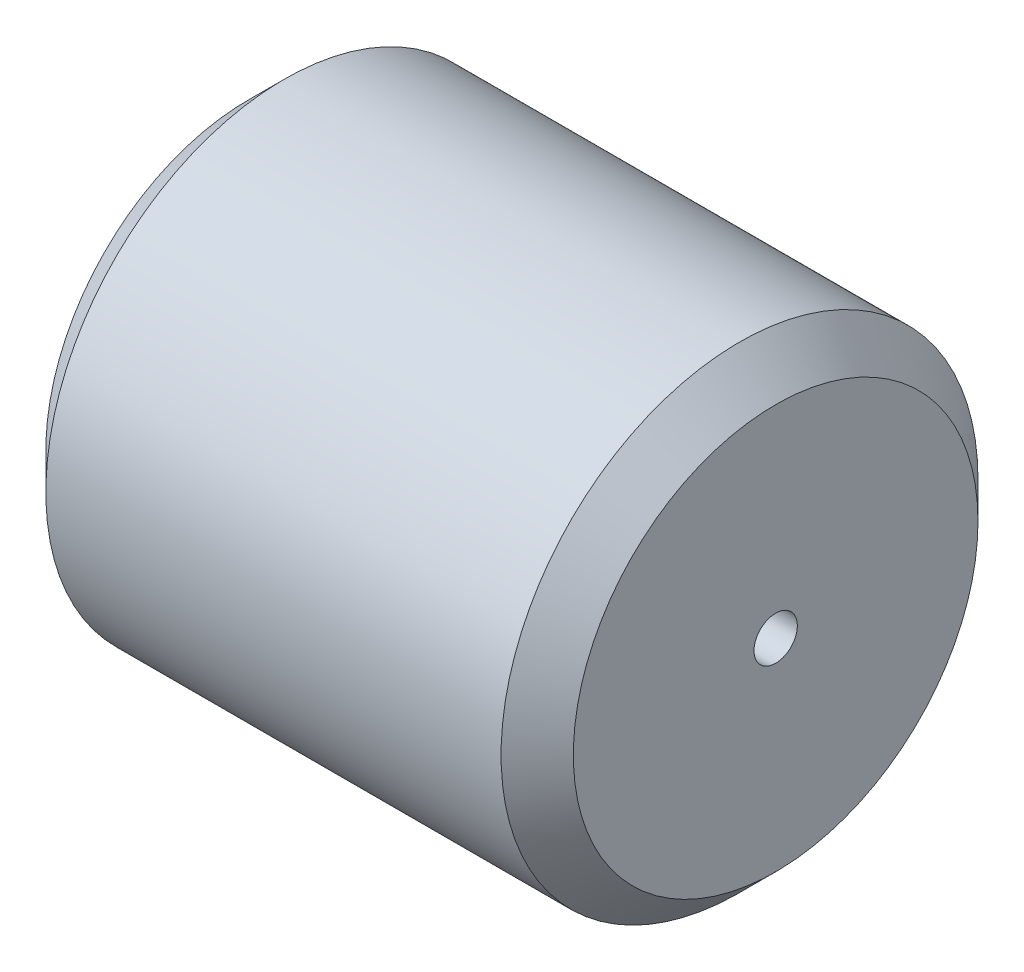
ISO-10303-21;
HEADER;
FILE_DESCRIPTION(('STEP AP214'),'2;1');
FILE_NAME('part.step','',(''),(''),'','','');
FILE_SCHEMA(('AUTOMOTIVE_DESIGN { 1 0 10303 214 1 1 1 1 }'));
ENDSEC;
DATA;
#1=APPLICATION_CONTEXT('core data for automotive mechanical design processes');
#2=APPLICATION_PROTOCOL_DEFINITION('international standard','automotive_design',2000,#1);
#3=PRODUCT_CONTEXT('',#1,'mechanical');
#4=PRODUCT('Part','Part','',(#3));
#5=PRODUCT_RELATED_PRODUCT_CATEGORY('part','',(#4));
#6=PRODUCT_DEFINITION_FORMATION('','',#4);
#7=PRODUCT_DEFINITION_CONTEXT('part definition',#1,'design');
#8=PRODUCT_DEFINITION('design','',#6,#7);
#9=PRODUCT_DEFINITION_SHAPE('','',#8);
#10=(LENGTH_UNIT() NAMED_UNIT(*) SI_UNIT(.MILLI.,.METRE.));
#11=(NAMED_UNIT(*) PLANE_ANGLE_UNIT() SI_UNIT($,.RADIAN.));
#12=(NAMED_UNIT(*) SI_UNIT($,.STERADIAN.) SOLID_ANGLE_UNIT());
#13=UNCERTAINTY_MEASURE_WITH_UNIT(LENGTH_MEASURE(1.E-05),#10,'distance_accuracy_value','');
#14=(GEOMETRIC_REPRESENTATION_CONTEXT(3) GLOBAL_UNCERTAINTY_ASSIGNED_CONTEXT((#13)) GLOBAL_UNIT_ASSIGNED_CONTEXT((#10,
#11,#12)) REPRESENTATION_CONTEXT('',''));
#15=CARTESIAN_POINT('',(0.,0.,0.));
#16=DIRECTION('',(0.,0.,1.));
#17=DIRECTION('',(1.,0.,0.));
#18=AXIS2_PLACEMENT_3D('',#15,#16,#17);
#19=CARTESIAN_POINT('',(36.5,0.,0.));
#20=DIRECTION('',(1.,0.,0.));
#21=DIRECTION('',(0.,0.,-1.));
#22=AXIS2_PLACEMENT_3D('',#19,#20,#21);
#23=PLANE('',#22);
#24=CARTESIAN_POINT('',(36.5,0.,0.));
#25=DIRECTION('',(1.,0.,0.));
#26=DIRECTION('',(0.,0.,-1.));
#27=AXIS2_PLACEMENT_3D('',#24,#25,#26);
#28=CIRCLE('',#27,28.);
#29=CARTESIAN_POINT('',(36.5,0.,-28.));
#30=VERTEX_POINT('',#29);
#31=EDGE_CURVE('E11',#30,#30,#28,.T.);
#32=ORIENTED_EDGE('',*,*,#31,.T.);
#33=EDGE_LOOP('',(#32));
#34=FACE_BOUND('',#33,.T.);
#35=CARTESIAN_POINT('',(36.5,0.,0.));
#36=DIRECTION('',(1.,0.,0.));
#37=DIRECTION('',(0.,0.,-1.));
#38=AXIS2_PLACEMENT_3D('',#35,#36,#37);
#39=CIRCLE('',#38,3.);
#40=CARTESIAN_POINT('',(36.5,0.,-3.));
#41=VERTEX_POINT('',#40);
#42=EDGE_CURVE('E55',#41,#41,#39,.T.);
#43=ORIENTED_EDGE('',*,*,#42,.F.);
#44=EDGE_LOOP('',(#43));
#45=FACE_BOUND('',#44,.T.);
#46=ADVANCED_FACE('F35',(#34,#45),#23,.T.);
#47=CARTESIAN_POINT('',(-36.5,0.,0.));
#48=DIRECTION('',(1.,0.,0.));
#49=DIRECTION('',(0.,0.,-1.));
#50=AXIS2_PLACEMENT_3D('',#47,#48,#49);
#51=PLANE('',#50);
#52=CARTESIAN_POINT('',(-36.5,0.,0.));
#53=DIRECTION('',(1.,0.,0.));
#54=DIRECTION('',(0.,0.,-1.));
#55=AXIS2_PLACEMENT_3D('',#52,#53,#54);
#56=CIRCLE('',#55,28.);
#57=CARTESIAN_POINT('',(-36.5,0.,-28.));
#58=VERTEX_POINT('',#57);
#59=EDGE_CURVE('E42',#58,#58,#56,.F.);
#60=ORIENTED_EDGE('',*,*,#59,.T.);
#61=EDGE_LOOP('',(#60));
#62=FACE_BOUND('',#61,.T.);
#63=CARTESIAN_POINT('',(-36.5,0.,0.));
#64=DIRECTION('',(1.,0.,0.));
#65=DIRECTION('',(0.,0.,-1.));
#66=AXIS2_PLACEMENT_3D('',#63,#64,#65);
#67=CIRCLE('',#66,3.);
#68=CARTESIAN_POINT('',(-36.5,0.,-3.));
#69=VERTEX_POINT('',#68);
#70=EDGE_CURVE('E56',#69,#69,#67,.T.);
#71=ORIENTED_EDGE('',*,*,#70,.T.);
#72=EDGE_LOOP('',(#71));
#73=FACE_BOUND('',#72,.T.);
#74=ADVANCED_FACE('F66',(#62,#73),#51,.F.);
#75=CARTESIAN_POINT('',(36.5,0.,0.));
#76=DIRECTION('',(-1.,0.,0.));
#77=DIRECTION('',(0.,0.,1.));
#78=AXIS2_PLACEMENT_3D('',#75,#76,#77);
#79=CYLINDRICAL_SURFACE('',#78,33.);
#80=CARTESIAN_POINT('',(-31.5,0.,0.));
#81=DIRECTION('',(1.,0.,0.));
#82=DIRECTION('',(0.,0.,-1.));
#83=AXIS2_PLACEMENT_3D('',#80,#81,#82);
#84=CIRCLE('',#83,33.);
#85=CARTESIAN_POINT('',(-31.5,0.,-33.));
#86=VERTEX_POINT('',#85);
#87=EDGE_CURVE('E46',#86,#86,#84,.T.);
#88=ORIENTED_EDGE('',*,*,#87,.T.);
#89=EDGE_LOOP('',(#88));
#90=FACE_BOUND('',#89,.T.);
#91=CARTESIAN_POINT('',(31.5,0.,0.));
#92=DIRECTION('',(1.,0.,0.));
#93=DIRECTION('',(0.,0.,-1.));
#94=AXIS2_PLACEMENT_3D('',#91,#92,#93);
#95=CIRCLE('',#94,33.);
#96=CARTESIAN_POINT('',(31.5,0.,-33.));
#97=VERTEX_POINT('',#96);
#98=EDGE_CURVE('E50',#97,#97,#95,.F.);
#99=ORIENTED_EDGE('',*,*,#98,.T.);
#100=EDGE_LOOP('',(#99));
#101=FACE_BOUND('',#100,.T.);
#102=ADVANCED_FACE('F71',(#90,#101),#79,.T.);
#103=CARTESIAN_POINT('',(36.5,0.,0.));
#104=DIRECTION('',(-1.,0.,0.));
#105=DIRECTION('',(0.,0.,1.));
#106=AXIS2_PLACEMENT_3D('',#103,#104,#105);
#107=CYLINDRICAL_SURFACE('',#106,3.);
#108=ORIENTED_EDGE('',*,*,#42,.T.);
#109=EDGE_LOOP('',(#108));
#110=FACE_BOUND('',#109,.T.);
#111=ORIENTED_EDGE('',*,*,#70,.F.);
#112=EDGE_LOOP('',(#111));
#113=FACE_BOUND('',#112,.T.);
#114=ADVANCED_FACE('F62',(#110,#113),#107,.F.);
#115=CARTESIAN_POINT('',(-31.5,0.,0.));
#116=DIRECTION('',(1.,0.,0.));
#117=DIRECTION('',(0.,0.,-1.));
#118=AXIS2_PLACEMENT_3D('',#115,#116,#117);
#119=CONICAL_SURFACE('',#118,33.,0.785398163397451);
#120=ORIENTED_EDGE('',*,*,#59,.F.);
#121=EDGE_LOOP('',(#120));
#122=FACE_BOUND('',#121,.T.);
#123=ORIENTED_EDGE('',*,*,#87,.F.);
#124=EDGE_LOOP('',(#123));
#125=FACE_BOUND('',#124,.T.);
#126=ADVANCED_FACE('F77',(#122,#125),#119,.T.);
#127=CARTESIAN_POINT('',(36.5,0.,0.));
#128=DIRECTION('',(-1.,0.,0.));
#129=DIRECTION('',(0.,0.,1.));
#130=AXIS2_PLACEMENT_3D('',#127,#128,#129);
#131=CONICAL_SURFACE('',#130,28.,0.785398163397446);
#132=ORIENTED_EDGE('',*,*,#98,.F.);
#133=EDGE_LOOP('',(#132));
#134=FACE_BOUND('',#133,.T.);
#135=ORIENTED_EDGE('',*,*,#31,.F.);
#136=EDGE_LOOP('',(#135));
#137=FACE_BOUND('',#136,.T.);
#138=ADVANCED_FACE('F37',(#134,#137),#131,.T.);
#139=CLOSED_SHELL('',(#46,#74,#102,#114,#126,#138));
#140=MANIFOLD_SOLID_BREP('B2',#139);
#141=ADVANCED_BREP_SHAPE_REPRESENTATION('',(#18,#140),#14);
#142=SHAPE_DEFINITION_REPRESENTATION(#9,#141);
ENDSEC;
END-ISO-10303-21;
